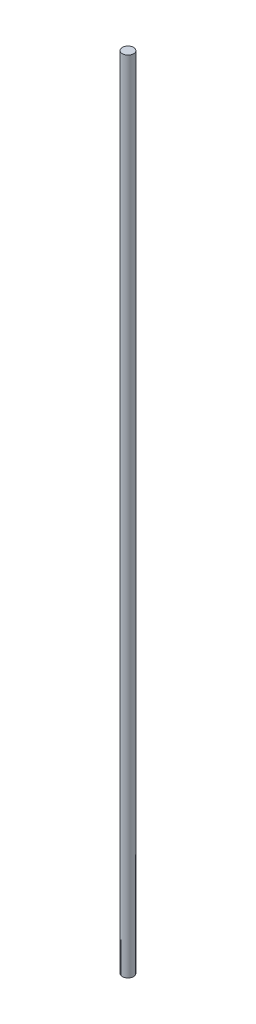
ISO-10303-21;
HEADER;
FILE_DESCRIPTION(('STEP AP214'),'2;1');
FILE_NAME('part.step','',(''),(''),'','','');
FILE_SCHEMA(('AUTOMOTIVE_DESIGN { 1 0 10303 214 1 1 1 1 }'));
ENDSEC;
DATA;
#1=APPLICATION_CONTEXT('core data for automotive mechanical design processes');
#2=APPLICATION_PROTOCOL_DEFINITION('international standard','automotive_design',2000,#1);
#3=PRODUCT_CONTEXT('',#1,'mechanical');
#4=PRODUCT('Part','Part','',(#3));
#5=PRODUCT_RELATED_PRODUCT_CATEGORY('part','',(#4));
#6=PRODUCT_DEFINITION_FORMATION('','',#4);
#7=PRODUCT_DEFINITION_CONTEXT('part definition',#1,'design');
#8=PRODUCT_DEFINITION('design','',#6,#7);
#9=PRODUCT_DEFINITION_SHAPE('','',#8);
#10=(LENGTH_UNIT() NAMED_UNIT(*) SI_UNIT(.MILLI.,.METRE.));
#11=(NAMED_UNIT(*) PLANE_ANGLE_UNIT() SI_UNIT($,.RADIAN.));
#12=(NAMED_UNIT(*) SI_UNIT($,.STERADIAN.) SOLID_ANGLE_UNIT());
#13=UNCERTAINTY_MEASURE_WITH_UNIT(LENGTH_MEASURE(1.E-05),#10,'distance_accuracy_value','');
#14=(GEOMETRIC_REPRESENTATION_CONTEXT(3) GLOBAL_UNCERTAINTY_ASSIGNED_CONTEXT((#13)) GLOBAL_UNIT_ASSIGNED_CONTEXT((#10,
#11,#12)) REPRESENTATION_CONTEXT('',''));
#15=CARTESIAN_POINT('',(0.,0.,0.));
#16=DIRECTION('',(0.,0.,1.));
#17=DIRECTION('',(1.,0.,0.));
#18=AXIS2_PLACEMENT_3D('',#15,#16,#17);
#19=CARTESIAN_POINT('',(0.,430.,0.));
#20=DIRECTION('',(0.,-1.,0.));
#21=DIRECTION('',(0.,0.,-1.));
#22=AXIS2_PLACEMENT_3D('',#19,#20,#21);
#23=CYLINDRICAL_SURFACE('',#22,3.);
#24=CARTESIAN_POINT('',(0.,430.,0.));
#25=DIRECTION('',(0.,1.,0.));
#26=DIRECTION('',(0.,0.,1.));
#27=AXIS2_PLACEMENT_3D('',#24,#25,#26);
#28=CIRCLE('',#27,3.);
#29=CARTESIAN_POINT('',(0.,430.,3.));
#30=VERTEX_POINT('',#29);
#31=EDGE_CURVE('E10',#30,#30,#28,.T.);
#32=ORIENTED_EDGE('',*,*,#31,.F.);
#33=EDGE_LOOP('',(#32));
#34=FACE_BOUND('',#33,.T.);
#35=CARTESIAN_POINT('',(0.,0.,0.));
#36=DIRECTION('',(0.,1.,0.));
#37=DIRECTION('',(0.,0.,1.));
#38=AXIS2_PLACEMENT_3D('',#35,#36,#37);
#39=CIRCLE('',#38,3.);
#40=CARTESIAN_POINT('',(0.,0.,3.));
#41=VERTEX_POINT('',#40);
#42=EDGE_CURVE('E40',#41,#41,#39,.T.);
#43=ORIENTED_EDGE('',*,*,#42,.T.);
#44=EDGE_LOOP('',(#43));
#45=FACE_BOUND('',#44,.T.);
#46=ADVANCED_FACE('F37',(#34,#45),#23,.T.);
#47=CARTESIAN_POINT('',(0.,430.,0.));
#48=DIRECTION('',(0.,1.,0.));
#49=DIRECTION('',(0.,0.,1.));
#50=AXIS2_PLACEMENT_3D('',#47,#48,#49);
#51=PLANE('',#50);
#52=ORIENTED_EDGE('',*,*,#31,.T.);
#53=EDGE_LOOP('',(#52));
#54=FACE_BOUND('',#53,.T.);
#55=ADVANCED_FACE('F54',(#54),#51,.T.);
#56=CARTESIAN_POINT('',(0.,0.,0.));
#57=DIRECTION('',(0.,1.,0.));
#58=DIRECTION('',(0.,0.,1.));
#59=AXIS2_PLACEMENT_3D('',#56,#57,#58);
#60=PLANE('',#59);
#61=ORIENTED_EDGE('',*,*,#42,.F.);
#62=EDGE_LOOP('',(#61));
#63=FACE_BOUND('',#62,.T.);
#64=ADVANCED_FACE('F52',(#63),#60,.F.);
#65=CLOSED_SHELL('',(#46,#55,#64));
#66=MANIFOLD_SOLID_BREP('B2',#65);
#67=ADVANCED_BREP_SHAPE_REPRESENTATION('',(#18,#66),#14);
#68=SHAPE_DEFINITION_REPRESENTATION(#9,#67);
ENDSEC;
END-ISO-10303-21;
